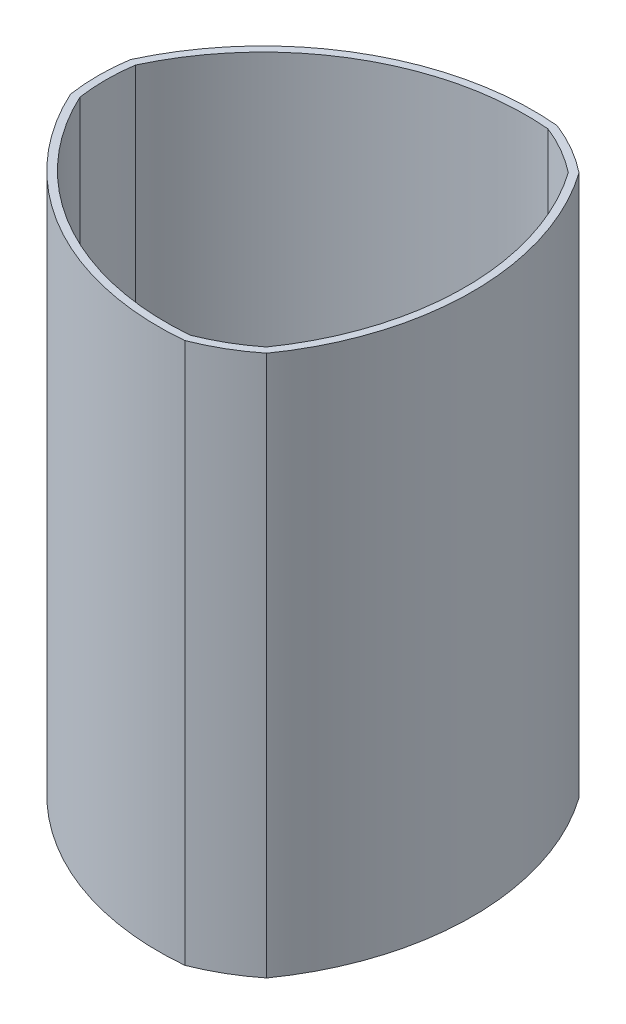
ISO-10303-21;
HEADER;
FILE_DESCRIPTION(('STEP AP214'),'2;1');
FILE_NAME('part.step','',(''),(''),'','','');
FILE_SCHEMA(('AUTOMOTIVE_DESIGN { 1 0 10303 214 1 1 1 1 }'));
ENDSEC;
DATA;
#1=APPLICATION_CONTEXT('core data for automotive mechanical design processes');
#2=APPLICATION_PROTOCOL_DEFINITION('international standard','automotive_design',2000,#1);
#3=PRODUCT_CONTEXT('',#1,'mechanical');
#4=PRODUCT('Part','Part','',(#3));
#5=PRODUCT_RELATED_PRODUCT_CATEGORY('part','',(#4));
#6=PRODUCT_DEFINITION_FORMATION('','',#4);
#7=PRODUCT_DEFINITION_CONTEXT('part definition',#1,'design');
#8=PRODUCT_DEFINITION('design','',#6,#7);
#9=PRODUCT_DEFINITION_SHAPE('','',#8);
#10=(LENGTH_UNIT() NAMED_UNIT(*) SI_UNIT(.MILLI.,.METRE.));
#11=(NAMED_UNIT(*) PLANE_ANGLE_UNIT() SI_UNIT($,.RADIAN.));
#12=(NAMED_UNIT(*) SI_UNIT($,.STERADIAN.) SOLID_ANGLE_UNIT());
#13=UNCERTAINTY_MEASURE_WITH_UNIT(LENGTH_MEASURE(1.E-05),#10,'distance_accuracy_value','');
#14=(GEOMETRIC_REPRESENTATION_CONTEXT(3) GLOBAL_UNCERTAINTY_ASSIGNED_CONTEXT((#13)) GLOBAL_UNIT_ASSIGNED_CONTEXT((#10,
#11,#12)) REPRESENTATION_CONTEXT('',''));
#15=CARTESIAN_POINT('',(0.,0.,0.));
#16=DIRECTION('',(0.,0.,1.));
#17=DIRECTION('',(1.,0.,0.));
#18=AXIS2_PLACEMENT_3D('',#15,#16,#17);
#19=CARTESIAN_POINT('',(10.1537856011036,228.599999999999,-17.5868725502727));
#20=DIRECTION('',(0.,-1.,0.));
#21=DIRECTION('',(0.,0.,-1.));
#22=AXIS2_PLACEMENT_3D('',#19,#20,#21);
#23=PLANE('',#22);
#24=CARTESIAN_POINT('',(20.3075712022071,228.599999999999,-35.1737451005455));
#25=DIRECTION('',(0.,1.,0.));
#26=DIRECTION('',(0.,0.,-1.));
#27=AXIS2_PLACEMENT_3D('',#24,#25,#26);
#28=CIRCLE('',#27,114.3);
#29=CARTESIAN_POINT('',(-83.500112781954,228.599999999999,12.664051105431));
#30=VERTEX_POINT('',#29);
#31=CARTESIAN_POINT('',(30.7826664188494,228.599999999999,78.6452444407533));
#32=VERTEX_POINT('',#31);
#33=EDGE_CURVE('E294',#30,#32,#28,.T.);
#34=ORIENTED_EDGE('',*,*,#33,.T.);
#35=CARTESIAN_POINT('',(0.,228.599999999999,0.));
#36=DIRECTION('',(0.,1.,0.));
#37=DIRECTION('',(0.,0.,1.));
#38=AXIS2_PLACEMENT_3D('',#35,#36,#37);
#39=CIRCLE('',#38,84.455);
#40=CARTESIAN_POINT('',(52.7174463631047,228.599999999999,65.9811933353223));
#41=VERTEX_POINT('',#40);
#42=EDGE_CURVE('E297',#32,#41,#39,.T.);
#43=ORIENTED_EDGE('',*,*,#42,.T.);
#44=CARTESIAN_POINT('',(-40.6151424044144,228.599999999999,0.));
#45=DIRECTION('',(0.,1.,0.));
#46=DIRECTION('',(0.,0.,-1.));
#47=AXIS2_PLACEMENT_3D('',#44,#45,#46);
#48=CIRCLE('',#47,114.3);
#49=CARTESIAN_POINT('',(52.7174463631046,228.599999999999,-65.9811933353224));
#50=VERTEX_POINT('',#49);
#51=EDGE_CURVE('E300',#41,#50,#48,.T.);
#52=ORIENTED_EDGE('',*,*,#51,.T.);
#53=CARTESIAN_POINT('',(0.,228.599999999999,0.));
#54=DIRECTION('',(0.,1.,0.));
#55=DIRECTION('',(0.,0.,1.));
#56=AXIS2_PLACEMENT_3D('',#53,#54,#55);
#57=CIRCLE('',#56,84.455);
#58=CARTESIAN_POINT('',(30.7826664188494,228.599999999999,-78.6452444407534));
#59=VERTEX_POINT('',#58);
#60=EDGE_CURVE('E302',#50,#59,#57,.T.);
#61=ORIENTED_EDGE('',*,*,#60,.T.);
#62=CARTESIAN_POINT('',(20.3075712022072,228.599999999999,35.1737451005455));
#63=DIRECTION('',(0.,1.,0.));
#64=DIRECTION('',(0.,0.,-1.));
#65=AXIS2_PLACEMENT_3D('',#62,#63,#64);
#66=CIRCLE('',#65,114.3);
#67=CARTESIAN_POINT('',(-83.500112781954,228.599999999999,-12.664051105431));
#68=VERTEX_POINT('',#67);
#69=EDGE_CURVE('E304',#59,#68,#66,.T.);
#70=ORIENTED_EDGE('',*,*,#69,.T.);
#71=CARTESIAN_POINT('',(0.,228.599999999999,0.));
#72=DIRECTION('',(0.,1.,0.));
#73=DIRECTION('',(0.,0.,1.));
#74=AXIS2_PLACEMENT_3D('',#71,#72,#73);
#75=CIRCLE('',#74,84.455);
#76=EDGE_CURVE('E306',#68,#30,#75,.T.);
#77=ORIENTED_EDGE('',*,*,#76,.T.);
#78=EDGE_LOOP('',(#34,#43,#52,#61,#70,#77));
#79=FACE_BOUND('',#78,.T.);
#80=CARTESIAN_POINT('',(0.,228.599999999999,0.));
#81=DIRECTION('',(0.,1.,0.));
#82=DIRECTION('',(0.,0.,1.));
#83=AXIS2_PLACEMENT_3D('',#80,#81,#82);
#84=CIRCLE('',#83,81.28);
#85=CARTESIAN_POINT('',(50.3843787092607,228.599999999999,-63.7797207745675));
#86=VERTEX_POINT('',#85);
#87=CARTESIAN_POINT('',(30.0426690824231,228.599999999999,-75.5240123033993));
#88=VERTEX_POINT('',#87);
#89=EDGE_CURVE('E263',#86,#88,#84,.T.);
#90=ORIENTED_EDGE('',*,*,#89,.F.);
#91=CARTESIAN_POINT('',(-40.6151424044144,228.599999999999,0.));
#92=DIRECTION('',(0.,1.,0.));
#93=DIRECTION('',(0.,0.,-1.));
#94=AXIS2_PLACEMENT_3D('',#91,#92,#93);
#95=CIRCLE('',#94,111.125);
#96=CARTESIAN_POINT('',(50.3843787092608,228.599999999999,63.7797207745674));
#97=VERTEX_POINT('',#96);
#98=EDGE_CURVE('E274',#97,#86,#95,.T.);
#99=ORIENTED_EDGE('',*,*,#98,.F.);
#100=CARTESIAN_POINT('',(0.,228.599999999999,0.));
#101=DIRECTION('',(0.,1.,0.));
#102=DIRECTION('',(0.,0.,1.));
#103=AXIS2_PLACEMENT_3D('',#100,#101,#102);
#104=CIRCLE('',#103,81.28);
#105=CARTESIAN_POINT('',(30.0426690824233,228.599999999999,75.5240123033993));
#106=VERTEX_POINT('',#105);
#107=EDGE_CURVE('E271',#106,#97,#104,.T.);
#108=ORIENTED_EDGE('',*,*,#107,.F.);
#109=CARTESIAN_POINT('',(20.3075712022071,228.599999999999,-35.1737451005455));
#110=DIRECTION('',(0.,1.,0.));
#111=DIRECTION('',(0.,0.,-1.));
#112=AXIS2_PLACEMENT_3D('',#109,#110,#111);
#113=CIRCLE('',#112,111.125);
#114=CARTESIAN_POINT('',(-80.4270477916838,228.599999999999,11.7442915288321));
#115=VERTEX_POINT('',#114);
#116=EDGE_CURVE('E269',#115,#106,#113,.T.);
#117=ORIENTED_EDGE('',*,*,#116,.F.);
#118=CARTESIAN_POINT('',(0.,228.599999999999,0.));
#119=DIRECTION('',(0.,1.,0.));
#120=DIRECTION('',(0.,0.,1.));
#121=AXIS2_PLACEMENT_3D('',#118,#119,#120);
#122=CIRCLE('',#121,81.28);
#123=CARTESIAN_POINT('',(-80.4270477916839,228.599999999999,-11.7442915288319));
#124=VERTEX_POINT('',#123);
#125=EDGE_CURVE('E267',#124,#115,#122,.T.);
#126=ORIENTED_EDGE('',*,*,#125,.F.);
#127=CARTESIAN_POINT('',(20.3075712022072,228.599999999999,35.1737451005455));
#128=DIRECTION('',(0.,1.,0.));
#129=DIRECTION('',(0.,0.,-1.));
#130=AXIS2_PLACEMENT_3D('',#127,#128,#129);
#131=CIRCLE('',#130,111.125);
#132=EDGE_CURVE('E265',#88,#124,#131,.T.);
#133=ORIENTED_EDGE('',*,*,#132,.F.);
#134=EDGE_LOOP('',(#90,#99,#108,#117,#126,#133));
#135=FACE_BOUND('',#134,.T.);
#136=ADVANCED_FACE('F38',(#79,#135),#23,.F.);
#137=CARTESIAN_POINT('',(10.1537856011036,0.,-17.5868725502727));
#138=DIRECTION('',(0.,-1.,0.));
#139=DIRECTION('',(0.,0.,-1.));
#140=AXIS2_PLACEMENT_3D('',#137,#138,#139);
#141=PLANE('',#140);
#142=DIRECTION('',(0.,0.,1.));
#143=VECTOR('',#142,1.);
#144=CARTESIAN_POINT('',(-6.60400000000001,0.,-44.7675));
#145=LINE('',#144,#143);
#146=CARTESIAN_POINT('',(-6.60400000000001,0.,-44.7675));
#147=VERTEX_POINT('',#146);
#148=CARTESIAN_POINT('',(-6.60400000000001,0.,-43.2435));
#149=VERTEX_POINT('',#148);
#150=EDGE_CURVE('E179',#147,#149,#145,.T.);
#151=ORIENTED_EDGE('',*,*,#150,.T.);
#152=DIRECTION('',(1.,0.,0.));
#153=VECTOR('',#152,1.);
#154=CARTESIAN_POINT('',(-6.60400000000001,0.,-43.2435));
#155=LINE('',#154,#153);
#156=CARTESIAN_POINT('',(6.60399999999999,0.,-43.2435));
#157=VERTEX_POINT('',#156);
#158=EDGE_CURVE('E190',#149,#157,#155,.T.);
#159=ORIENTED_EDGE('',*,*,#158,.T.);
#160=DIRECTION('',(0.,0.,-1.));
#161=VECTOR('',#160,1.);
#162=CARTESIAN_POINT('',(6.60399999999999,0.,-44.7675));
#163=LINE('',#162,#161);
#164=CARTESIAN_POINT('',(6.60399999999999,0.,-44.7675));
#165=VERTEX_POINT('',#164);
#166=EDGE_CURVE('E53',#157,#165,#163,.T.);
#167=ORIENTED_EDGE('',*,*,#166,.T.);
#168=DIRECTION('',(-1.,0.,0.));
#169=VECTOR('',#168,1.);
#170=CARTESIAN_POINT('',(-6.60400000000001,0.,-44.7675));
#171=LINE('',#170,#169);
#172=EDGE_CURVE('E187',#165,#147,#171,.T.);
#173=ORIENTED_EDGE('',*,*,#172,.T.);
#174=EDGE_LOOP('',(#151,#159,#167,#173));
#175=FACE_BOUND('',#174,.T.);
#176=DIRECTION('',(0.,0.,1.));
#177=VECTOR('',#176,1.);
#178=CARTESIAN_POINT('',(-6.604,0.,44.7675));
#179=LINE('',#178,#177);
#180=CARTESIAN_POINT('',(-6.604,0.,44.7675));
#181=VERTEX_POINT('',#180);
#182=CARTESIAN_POINT('',(-6.604,0.,46.2915));
#183=VERTEX_POINT('',#182);
#184=EDGE_CURVE('E217',#181,#183,#179,.T.);
#185=ORIENTED_EDGE('',*,*,#184,.T.);
#186=DIRECTION('',(1.,0.,0.));
#187=VECTOR('',#186,1.);
#188=CARTESIAN_POINT('',(-6.604,0.,46.2915));
#189=LINE('',#188,#187);
#190=CARTESIAN_POINT('',(6.604,0.,46.2915));
#191=VERTEX_POINT('',#190);
#192=EDGE_CURVE('E220',#183,#191,#189,.T.);
#193=ORIENTED_EDGE('',*,*,#192,.T.);
#194=DIRECTION('',(0.,0.,-1.));
#195=VECTOR('',#194,1.);
#196=CARTESIAN_POINT('',(6.604,0.,44.7675));
#197=LINE('',#196,#195);
#198=CARTESIAN_POINT('',(6.604,0.,44.7675));
#199=VERTEX_POINT('',#198);
#200=EDGE_CURVE('E61',#191,#199,#197,.T.);
#201=ORIENTED_EDGE('',*,*,#200,.T.);
#202=DIRECTION('',(-1.,0.,0.));
#203=VECTOR('',#202,1.);
#204=CARTESIAN_POINT('',(-6.604,0.,44.7675));
#205=LINE('',#204,#203);
#206=EDGE_CURVE('E225',#199,#181,#205,.T.);
#207=ORIENTED_EDGE('',*,*,#206,.T.);
#208=EDGE_LOOP('',(#185,#193,#201,#207));
#209=FACE_BOUND('',#208,.T.);
#210=CARTESIAN_POINT('',(20.3075712022071,0.,-35.1737451005455));
#211=DIRECTION('',(0.,1.,0.));
#212=DIRECTION('',(0.,0.,-1.));
#213=AXIS2_PLACEMENT_3D('',#210,#211,#212);
#214=CIRCLE('',#213,114.3);
#215=CARTESIAN_POINT('',(-83.500112781954,0.,12.664051105431));
#216=VERTEX_POINT('',#215);
#217=CARTESIAN_POINT('',(30.7826664188494,0.,78.6452444407533));
#218=VERTEX_POINT('',#217);
#219=EDGE_CURVE('E293',#216,#218,#214,.T.);
#220=ORIENTED_EDGE('',*,*,#219,.F.);
#221=CARTESIAN_POINT('',(0.,0.,0.));
#222=DIRECTION('',(0.,1.,0.));
#223=DIRECTION('',(0.,0.,1.));
#224=AXIS2_PLACEMENT_3D('',#221,#222,#223);
#225=CIRCLE('',#224,84.455);
#226=CARTESIAN_POINT('',(-83.500112781954,0.,-12.664051105431));
#227=VERTEX_POINT('',#226);
#228=EDGE_CURVE('E298',#227,#216,#225,.T.);
#229=ORIENTED_EDGE('',*,*,#228,.F.);
#230=CARTESIAN_POINT('',(20.3075712022072,0.,35.1737451005455));
#231=DIRECTION('',(0.,1.,0.));
#232=DIRECTION('',(0.,0.,-1.));
#233=AXIS2_PLACEMENT_3D('',#230,#231,#232);
#234=CIRCLE('',#233,114.3);
#235=CARTESIAN_POINT('',(30.7826664188494,0.,-78.6452444407534));
#236=VERTEX_POINT('',#235);
#237=EDGE_CURVE('E317',#236,#227,#234,.T.);
#238=ORIENTED_EDGE('',*,*,#237,.F.);
#239=CARTESIAN_POINT('',(0.,0.,0.));
#240=DIRECTION('',(0.,1.,0.));
#241=DIRECTION('',(0.,0.,1.));
#242=AXIS2_PLACEMENT_3D('',#239,#240,#241);
#243=CIRCLE('',#242,84.455);
#244=CARTESIAN_POINT('',(52.7174463631046,0.,-65.9811933353224));
#245=VERTEX_POINT('',#244);
#246=EDGE_CURVE('E315',#245,#236,#243,.T.);
#247=ORIENTED_EDGE('',*,*,#246,.F.);
#248=CARTESIAN_POINT('',(-40.6151424044144,0.,0.));
#249=DIRECTION('',(0.,1.,0.));
#250=DIRECTION('',(0.,0.,-1.));
#251=AXIS2_PLACEMENT_3D('',#248,#249,#250);
#252=CIRCLE('',#251,114.3);
#253=CARTESIAN_POINT('',(52.7174463631047,0.,65.9811933353223));
#254=VERTEX_POINT('',#253);
#255=EDGE_CURVE('E313',#254,#245,#252,.T.);
#256=ORIENTED_EDGE('',*,*,#255,.F.);
#257=CARTESIAN_POINT('',(0.,0.,0.));
#258=DIRECTION('',(0.,1.,0.));
#259=DIRECTION('',(0.,0.,1.));
#260=AXIS2_PLACEMENT_3D('',#257,#258,#259);
#261=CIRCLE('',#260,84.455);
#262=EDGE_CURVE('E311',#218,#254,#261,.T.);
#263=ORIENTED_EDGE('',*,*,#262,.F.);
#264=EDGE_LOOP('',(#220,#229,#238,#247,#256,#263));
#265=FACE_BOUND('',#264,.T.);
#266=ADVANCED_FACE('F194',(#175,#209,#265),#141,.T.);
#267=CARTESIAN_POINT('',(20.3075712022071,228.599999999999,-35.1737451005455));
#268=DIRECTION('',(0.,-1.,0.));
#269=DIRECTION('',(0.,0.,-1.));
#270=AXIS2_PLACEMENT_3D('',#267,#268,#269);
#271=CYLINDRICAL_SURFACE('',#270,114.3);
#272=ORIENTED_EDGE('',*,*,#219,.T.);
#273=DIRECTION('',(0.,-1.,0.));
#274=VECTOR('',#273,1.);
#275=CARTESIAN_POINT('',(30.7826664188494,228.599999999999,78.6452444407533));
#276=LINE('',#275,#274);
#277=EDGE_CURVE('E11',#32,#218,#276,.T.);
#278=ORIENTED_EDGE('',*,*,#277,.F.);
#279=ORIENTED_EDGE('',*,*,#33,.F.);
#280=DIRECTION('',(0.,-1.,0.));
#281=VECTOR('',#280,1.);
#282=CARTESIAN_POINT('',(-83.500112781954,228.599999999999,12.664051105431));
#283=LINE('',#282,#281);
#284=EDGE_CURVE('E308',#30,#216,#283,.T.);
#285=ORIENTED_EDGE('',*,*,#284,.T.);
#286=EDGE_LOOP('',(#272,#278,#279,#285));
#287=FACE_BOUND('',#286,.T.);
#288=ADVANCED_FACE('F40',(#287),#271,.T.);
#289=CARTESIAN_POINT('',(0.,228.599999999999,0.));
#290=DIRECTION('',(0.,-1.,0.));
#291=DIRECTION('',(0.,0.,-1.));
#292=AXIS2_PLACEMENT_3D('',#289,#290,#291);
#293=CYLINDRICAL_SURFACE('',#292,84.455);
#294=ORIENTED_EDGE('',*,*,#262,.T.);
#295=DIRECTION('',(0.,-1.,0.));
#296=VECTOR('',#295,1.);
#297=CARTESIAN_POINT('',(52.7174463631047,228.599999999999,65.9811933353223));
#298=LINE('',#297,#296);
#299=EDGE_CURVE('E46',#41,#254,#298,.T.);
#300=ORIENTED_EDGE('',*,*,#299,.F.);
#301=ORIENTED_EDGE('',*,*,#42,.F.);
#302=ORIENTED_EDGE('',*,*,#277,.T.);
#303=EDGE_LOOP('',(#294,#300,#301,#302));
#304=FACE_BOUND('',#303,.T.);
#305=ADVANCED_FACE('F357',(#304),#293,.T.);
#306=CARTESIAN_POINT('',(-40.6151424044144,228.599999999999,0.));
#307=DIRECTION('',(0.,-1.,0.));
#308=DIRECTION('',(0.,0.,-1.));
#309=AXIS2_PLACEMENT_3D('',#306,#307,#308);
#310=CYLINDRICAL_SURFACE('',#309,114.3);
#311=ORIENTED_EDGE('',*,*,#255,.T.);
#312=DIRECTION('',(0.,-1.,0.));
#313=VECTOR('',#312,1.);
#314=CARTESIAN_POINT('',(52.7174463631046,228.599999999999,-65.9811933353224));
#315=LINE('',#314,#313);
#316=EDGE_CURVE('E328',#50,#245,#315,.T.);
#317=ORIENTED_EDGE('',*,*,#316,.F.);
#318=ORIENTED_EDGE('',*,*,#51,.F.);
#319=ORIENTED_EDGE('',*,*,#299,.T.);
#320=EDGE_LOOP('',(#311,#317,#318,#319));
#321=FACE_BOUND('',#320,.T.);
#322=ADVANCED_FACE('F335',(#321),#310,.T.);
#323=CARTESIAN_POINT('',(0.,228.599999999999,0.));
#324=DIRECTION('',(0.,-1.,0.));
#325=DIRECTION('',(0.,0.,-1.));
#326=AXIS2_PLACEMENT_3D('',#323,#324,#325);
#327=CYLINDRICAL_SURFACE('',#326,84.455);
#328=ORIENTED_EDGE('',*,*,#246,.T.);
#329=DIRECTION('',(0.,-1.,0.));
#330=VECTOR('',#329,1.);
#331=CARTESIAN_POINT('',(30.7826664188494,228.599999999999,-78.6452444407534));
#332=LINE('',#331,#330);
#333=EDGE_CURVE('E325',#59,#236,#332,.T.);
#334=ORIENTED_EDGE('',*,*,#333,.F.);
#335=ORIENTED_EDGE('',*,*,#60,.F.);
#336=ORIENTED_EDGE('',*,*,#316,.T.);
#337=EDGE_LOOP('',(#328,#334,#335,#336));
#338=FACE_BOUND('',#337,.T.);
#339=ADVANCED_FACE('F345',(#338),#327,.T.);
#340=CARTESIAN_POINT('',(20.3075712022072,228.599999999999,35.1737451005455));
#341=DIRECTION('',(0.,-1.,0.));
#342=DIRECTION('',(0.,0.,-1.));
#343=AXIS2_PLACEMENT_3D('',#340,#341,#342);
#344=CYLINDRICAL_SURFACE('',#343,114.3);
#345=ORIENTED_EDGE('',*,*,#237,.T.);
#346=DIRECTION('',(0.,-1.,0.));
#347=VECTOR('',#346,1.);
#348=CARTESIAN_POINT('',(-83.500112781954,228.599999999999,-12.664051105431));
#349=LINE('',#348,#347);
#350=EDGE_CURVE('E322',#68,#227,#349,.T.);
#351=ORIENTED_EDGE('',*,*,#350,.F.);
#352=ORIENTED_EDGE('',*,*,#69,.F.);
#353=ORIENTED_EDGE('',*,*,#333,.T.);
#354=EDGE_LOOP('',(#345,#351,#352,#353));
#355=FACE_BOUND('',#354,.T.);
#356=ADVANCED_FACE('F349',(#355),#344,.T.);
#357=CARTESIAN_POINT('',(0.,228.599999999999,0.));
#358=DIRECTION('',(0.,-1.,0.));
#359=DIRECTION('',(0.,0.,-1.));
#360=AXIS2_PLACEMENT_3D('',#357,#358,#359);
#361=CYLINDRICAL_SURFACE('',#360,84.455);
#362=ORIENTED_EDGE('',*,*,#228,.T.);
#363=ORIENTED_EDGE('',*,*,#284,.F.);
#364=ORIENTED_EDGE('',*,*,#76,.F.);
#365=ORIENTED_EDGE('',*,*,#350,.T.);
#366=EDGE_LOOP('',(#362,#363,#364,#365));
#367=FACE_BOUND('',#366,.T.);
#368=ADVANCED_FACE('F360',(#367),#361,.T.);
#369=CARTESIAN_POINT('',(0.,228.599999999999,0.));
#370=DIRECTION('',(0.,-1.,0.));
#371=DIRECTION('',(0.,0.,-1.));
#372=AXIS2_PLACEMENT_3D('',#369,#370,#371);
#373=CYLINDRICAL_SURFACE('',#372,81.28);
#374=CARTESIAN_POINT('',(0.,3.175,0.));
#375=DIRECTION('',(0.,1.,0.));
#376=DIRECTION('',(0.,0.,1.));
#377=AXIS2_PLACEMENT_3D('',#374,#375,#376);
#378=CIRCLE('',#377,81.28);
#379=CARTESIAN_POINT('',(50.3843787092607,3.175,-63.7797207745675));
#380=VERTEX_POINT('',#379);
#381=CARTESIAN_POINT('',(30.0426690824231,3.17500000000001,-75.5240123033993));
#382=VERTEX_POINT('',#381);
#383=EDGE_CURVE('E248',#380,#382,#378,.T.);
#384=ORIENTED_EDGE('',*,*,#383,.F.);
#385=DIRECTION('',(0.,-1.,0.));
#386=VECTOR('',#385,1.);
#387=CARTESIAN_POINT('',(50.3843787092607,228.599999999999,-63.7797207745675));
#388=LINE('',#387,#386);
#389=EDGE_CURVE('E276',#86,#380,#388,.T.);
#390=ORIENTED_EDGE('',*,*,#389,.F.);
#391=ORIENTED_EDGE('',*,*,#89,.T.);
#392=DIRECTION('',(0.,-1.,0.));
#393=VECTOR('',#392,1.);
#394=CARTESIAN_POINT('',(30.0426690824231,228.599999999999,-75.5240123033993));
#395=LINE('',#394,#393);
#396=EDGE_CURVE('E290',#88,#382,#395,.T.);
#397=ORIENTED_EDGE('',*,*,#396,.T.);
#398=EDGE_LOOP('',(#384,#390,#391,#397));
#399=FACE_BOUND('',#398,.T.);
#400=ADVANCED_FACE('F362',(#399),#373,.F.);
#401=CARTESIAN_POINT('',(20.3075712022072,228.599999999999,35.1737451005455));
#402=DIRECTION('',(0.,-1.,0.));
#403=DIRECTION('',(0.,0.,-1.));
#404=AXIS2_PLACEMENT_3D('',#401,#402,#403);
#405=CYLINDRICAL_SURFACE('',#404,111.125);
#406=CARTESIAN_POINT('',(20.3075712022072,3.175,35.1737451005455));
#407=DIRECTION('',(0.,1.,0.));
#408=DIRECTION('',(0.,0.,1.));
#409=AXIS2_PLACEMENT_3D('',#406,#407,#408);
#410=CIRCLE('',#409,111.125);
#411=CARTESIAN_POINT('',(-80.4270477916839,3.17500000000001,-11.7442915288319));
#412=VERTEX_POINT('',#411);
#413=EDGE_CURVE('E251',#382,#412,#410,.T.);
#414=ORIENTED_EDGE('',*,*,#413,.F.);
#415=ORIENTED_EDGE('',*,*,#396,.F.);
#416=ORIENTED_EDGE('',*,*,#132,.T.);
#417=DIRECTION('',(0.,-1.,0.));
#418=VECTOR('',#417,1.);
#419=CARTESIAN_POINT('',(-80.4270477916839,228.599999999999,-11.7442915288319));
#420=LINE('',#419,#418);
#421=EDGE_CURVE('E287',#124,#412,#420,.T.);
#422=ORIENTED_EDGE('',*,*,#421,.T.);
#423=EDGE_LOOP('',(#414,#415,#416,#422));
#424=FACE_BOUND('',#423,.T.);
#425=ADVANCED_FACE('F368',(#424),#405,.F.);
#426=CARTESIAN_POINT('',(0.,228.599999999999,0.));
#427=DIRECTION('',(0.,-1.,0.));
#428=DIRECTION('',(0.,0.,-1.));
#429=AXIS2_PLACEMENT_3D('',#426,#427,#428);
#430=CYLINDRICAL_SURFACE('',#429,81.28);
#431=CARTESIAN_POINT('',(0.,3.175,0.));
#432=DIRECTION('',(0.,1.,0.));
#433=DIRECTION('',(0.,0.,1.));
#434=AXIS2_PLACEMENT_3D('',#431,#432,#433);
#435=CIRCLE('',#434,81.28);
#436=CARTESIAN_POINT('',(-80.4270477916838,3.17500000000001,11.7442915288321));
#437=VERTEX_POINT('',#436);
#438=EDGE_CURVE('E254',#412,#437,#435,.T.);
#439=ORIENTED_EDGE('',*,*,#438,.F.);
#440=ORIENTED_EDGE('',*,*,#421,.F.);
#441=ORIENTED_EDGE('',*,*,#125,.T.);
#442=DIRECTION('',(0.,-1.,0.));
#443=VECTOR('',#442,1.);
#444=CARTESIAN_POINT('',(-80.4270477916838,228.599999999999,11.7442915288321));
#445=LINE('',#444,#443);
#446=EDGE_CURVE('E284',#115,#437,#445,.T.);
#447=ORIENTED_EDGE('',*,*,#446,.T.);
#448=EDGE_LOOP('',(#439,#440,#441,#447));
#449=FACE_BOUND('',#448,.T.);
#450=ADVANCED_FACE('F382',(#449),#430,.F.);
#451=CARTESIAN_POINT('',(20.3075712022071,228.599999999999,-35.1737451005455));
#452=DIRECTION('',(0.,-1.,0.));
#453=DIRECTION('',(0.,0.,-1.));
#454=AXIS2_PLACEMENT_3D('',#451,#452,#453);
#455=CYLINDRICAL_SURFACE('',#454,111.125);
#456=CARTESIAN_POINT('',(20.3075712022071,3.175,-35.1737451005455));
#457=DIRECTION('',(0.,1.,0.));
#458=DIRECTION('',(0.,0.,1.));
#459=AXIS2_PLACEMENT_3D('',#456,#457,#458);
#460=CIRCLE('',#459,111.125);
#461=CARTESIAN_POINT('',(30.0426690824233,3.17500000000001,75.5240123033993));
#462=VERTEX_POINT('',#461);
#463=EDGE_CURVE('E257',#437,#462,#460,.T.);
#464=ORIENTED_EDGE('',*,*,#463,.F.);
#465=ORIENTED_EDGE('',*,*,#446,.F.);
#466=ORIENTED_EDGE('',*,*,#116,.T.);
#467=DIRECTION('',(0.,-1.,0.));
#468=VECTOR('',#467,1.);
#469=CARTESIAN_POINT('',(30.0426690824233,228.599999999999,75.5240123033993));
#470=LINE('',#469,#468);
#471=EDGE_CURVE('E281',#106,#462,#470,.T.);
#472=ORIENTED_EDGE('',*,*,#471,.T.);
#473=EDGE_LOOP('',(#464,#465,#466,#472));
#474=FACE_BOUND('',#473,.T.);
#475=ADVANCED_FACE('F386',(#474),#455,.F.);
#476=CARTESIAN_POINT('',(0.,228.599999999999,0.));
#477=DIRECTION('',(0.,-1.,0.));
#478=DIRECTION('',(0.,0.,-1.));
#479=AXIS2_PLACEMENT_3D('',#476,#477,#478);
#480=CYLINDRICAL_SURFACE('',#479,81.28);
#481=CARTESIAN_POINT('',(0.,3.175,0.));
#482=DIRECTION('',(0.,1.,0.));
#483=DIRECTION('',(0.,0.,1.));
#484=AXIS2_PLACEMENT_3D('',#481,#482,#483);
#485=CIRCLE('',#484,81.28);
#486=CARTESIAN_POINT('',(50.3843787092608,3.17500000000001,63.7797207745674));
#487=VERTEX_POINT('',#486);
#488=EDGE_CURVE('E260',#462,#487,#485,.T.);
#489=ORIENTED_EDGE('',*,*,#488,.F.);
#490=ORIENTED_EDGE('',*,*,#471,.F.);
#491=ORIENTED_EDGE('',*,*,#107,.T.);
#492=DIRECTION('',(0.,-1.,0.));
#493=VECTOR('',#492,1.);
#494=CARTESIAN_POINT('',(50.3843787092608,228.599999999999,63.7797207745674));
#495=LINE('',#494,#493);
#496=EDGE_CURVE('E278',#97,#487,#495,.T.);
#497=ORIENTED_EDGE('',*,*,#496,.T.);
#498=EDGE_LOOP('',(#489,#490,#491,#497));
#499=FACE_BOUND('',#498,.T.);
#500=ADVANCED_FACE('F390',(#499),#480,.F.);
#501=CARTESIAN_POINT('',(-40.6151424044144,228.599999999999,0.));
#502=DIRECTION('',(0.,-1.,0.));
#503=DIRECTION('',(0.,0.,-1.));
#504=AXIS2_PLACEMENT_3D('',#501,#502,#503);
#505=CYLINDRICAL_SURFACE('',#504,111.125);
#506=CARTESIAN_POINT('',(-40.6151424044144,3.175,0.));
#507=DIRECTION('',(0.,1.,0.));
#508=DIRECTION('',(0.,0.,1.));
#509=AXIS2_PLACEMENT_3D('',#506,#507,#508);
#510=CIRCLE('',#509,111.125);
#511=EDGE_CURVE('E213',#487,#380,#510,.T.);
#512=ORIENTED_EDGE('',*,*,#511,.F.);
#513=ORIENTED_EDGE('',*,*,#496,.F.);
#514=ORIENTED_EDGE('',*,*,#98,.T.);
#515=ORIENTED_EDGE('',*,*,#389,.T.);
#516=EDGE_LOOP('',(#512,#513,#514,#515));
#517=FACE_BOUND('',#516,.T.);
#518=ADVANCED_FACE('F394',(#517),#505,.F.);
#519=CARTESIAN_POINT('',(-20.3075712022072,3.175,0.));
#520=DIRECTION('',(0.,1.,0.));
#521=DIRECTION('',(0.,0.,1.));
#522=AXIS2_PLACEMENT_3D('',#519,#520,#521);
#523=PLANE('',#522);
#524=DIRECTION('',(0.,0.,1.));
#525=VECTOR('',#524,1.);
#526=CARTESIAN_POINT('',(-6.60400000000001,3.175,-44.7675));
#527=LINE('',#526,#525);
#528=CARTESIAN_POINT('',(-6.60400000000001,3.175,-44.7675));
#529=VERTEX_POINT('',#528);
#530=CARTESIAN_POINT('',(-6.60400000000001,3.175,-43.2435));
#531=VERTEX_POINT('',#530);
#532=EDGE_CURVE('E182',#529,#531,#527,.T.);
#533=ORIENTED_EDGE('',*,*,#532,.F.);
#534=DIRECTION('',(-1.,0.,0.));
#535=VECTOR('',#534,1.);
#536=CARTESIAN_POINT('',(-6.60400000000001,3.175,-44.7675));
#537=LINE('',#536,#535);
#538=CARTESIAN_POINT('',(6.60399999999999,3.175,-44.7675));
#539=VERTEX_POINT('',#538);
#540=EDGE_CURVE('E197',#539,#529,#537,.T.);
#541=ORIENTED_EDGE('',*,*,#540,.F.);
#542=DIRECTION('',(0.,0.,-1.));
#543=VECTOR('',#542,1.);
#544=CARTESIAN_POINT('',(6.60399999999999,3.175,-44.7675));
#545=LINE('',#544,#543);
#546=CARTESIAN_POINT('',(6.60399999999999,3.175,-43.2435));
#547=VERTEX_POINT('',#546);
#548=EDGE_CURVE('E200',#547,#539,#545,.T.);
#549=ORIENTED_EDGE('',*,*,#548,.F.);
#550=DIRECTION('',(1.,0.,0.));
#551=VECTOR('',#550,1.);
#552=CARTESIAN_POINT('',(-6.60400000000001,3.175,-43.2435));
#553=LINE('',#552,#551);
#554=EDGE_CURVE('E206',#531,#547,#553,.T.);
#555=ORIENTED_EDGE('',*,*,#554,.F.);
#556=EDGE_LOOP('',(#533,#541,#549,#555));
#557=FACE_BOUND('',#556,.T.);
#558=DIRECTION('',(0.,0.,1.));
#559=VECTOR('',#558,1.);
#560=CARTESIAN_POINT('',(-6.604,3.175,44.7675));
#561=LINE('',#560,#559);
#562=CARTESIAN_POINT('',(-6.604,3.175,44.7675));
#563=VERTEX_POINT('',#562);
#564=CARTESIAN_POINT('',(-6.604,3.175,46.2915));
#565=VERTEX_POINT('',#564);
#566=EDGE_CURVE('E229',#563,#565,#561,.T.);
#567=ORIENTED_EDGE('',*,*,#566,.F.);
#568=DIRECTION('',(-1.,0.,0.));
#569=VECTOR('',#568,1.);
#570=CARTESIAN_POINT('',(-6.604,3.175,44.7675));
#571=LINE('',#570,#569);
#572=CARTESIAN_POINT('',(6.604,3.175,44.7675));
#573=VERTEX_POINT('',#572);
#574=EDGE_CURVE('E221',#573,#563,#571,.T.);
#575=ORIENTED_EDGE('',*,*,#574,.F.);
#576=DIRECTION('',(0.,0.,-1.));
#577=VECTOR('',#576,1.);
#578=CARTESIAN_POINT('',(6.604,3.175,44.7675));
#579=LINE('',#578,#577);
#580=CARTESIAN_POINT('',(6.604,3.175,46.2915));
#581=VERTEX_POINT('',#580);
#582=EDGE_CURVE('E234',#581,#573,#579,.T.);
#583=ORIENTED_EDGE('',*,*,#582,.F.);
#584=DIRECTION('',(1.,0.,0.));
#585=VECTOR('',#584,1.);
#586=CARTESIAN_POINT('',(-6.604,3.175,46.2915));
#587=LINE('',#586,#585);
#588=EDGE_CURVE('E231',#565,#581,#587,.T.);
#589=ORIENTED_EDGE('',*,*,#588,.F.);
#590=EDGE_LOOP('',(#567,#575,#583,#589));
#591=FACE_BOUND('',#590,.T.);
#592=ORIENTED_EDGE('',*,*,#511,.T.);
#593=ORIENTED_EDGE('',*,*,#383,.T.);
#594=ORIENTED_EDGE('',*,*,#413,.T.);
#595=ORIENTED_EDGE('',*,*,#438,.T.);
#596=ORIENTED_EDGE('',*,*,#463,.T.);
#597=ORIENTED_EDGE('',*,*,#488,.T.);
#598=EDGE_LOOP('',(#592,#593,#594,#595,#596,#597));
#599=FACE_BOUND('',#598,.T.);
#600=ADVANCED_FACE('F398',(#557,#591,#599),#523,.T.);
#601=CARTESIAN_POINT('',(-6.604,0.,44.7675));
#602=DIRECTION('',(-1.,0.,0.));
#603=DIRECTION('',(0.,0.,1.));
#604=AXIS2_PLACEMENT_3D('',#601,#602,#603);
#605=PLANE('',#604);
#606=ORIENTED_EDGE('',*,*,#566,.T.);
#607=DIRECTION('',(0.,1.,0.));
#608=VECTOR('',#607,1.);
#609=CARTESIAN_POINT('',(-6.604,0.,46.2915));
#610=LINE('',#609,#608);
#611=EDGE_CURVE('E228',#183,#565,#610,.T.);
#612=ORIENTED_EDGE('',*,*,#611,.F.);
#613=ORIENTED_EDGE('',*,*,#184,.F.);
#614=DIRECTION('',(0.,1.,0.));
#615=VECTOR('',#614,1.);
#616=CARTESIAN_POINT('',(-6.604,0.,44.7675));
#617=LINE('',#616,#615);
#618=EDGE_CURVE('E207',#181,#563,#617,.T.);
#619=ORIENTED_EDGE('',*,*,#618,.T.);
#620=EDGE_LOOP('',(#606,#612,#613,#619));
#621=FACE_BOUND('',#620,.T.);
#622=ADVANCED_FACE('F402',(#621),#605,.F.);
#623=CARTESIAN_POINT('',(-6.604,0.,44.7675));
#624=DIRECTION('',(0.,0.,-1.));
#625=DIRECTION('',(-1.,0.,0.));
#626=AXIS2_PLACEMENT_3D('',#623,#624,#625);
#627=PLANE('',#626);
#628=ORIENTED_EDGE('',*,*,#574,.T.);
#629=ORIENTED_EDGE('',*,*,#618,.F.);
#630=ORIENTED_EDGE('',*,*,#206,.F.);
#631=DIRECTION('',(0.,1.,0.));
#632=VECTOR('',#631,1.);
#633=CARTESIAN_POINT('',(6.604,0.,44.7675));
#634=LINE('',#633,#632);
#635=EDGE_CURVE('E240',#199,#573,#634,.T.);
#636=ORIENTED_EDGE('',*,*,#635,.T.);
#637=EDGE_LOOP('',(#628,#629,#630,#636));
#638=FACE_BOUND('',#637,.T.);
#639=ADVANCED_FACE('F406',(#638),#627,.F.);
#640=CARTESIAN_POINT('',(6.604,0.,44.7675));
#641=DIRECTION('',(1.,0.,0.));
#642=DIRECTION('',(0.,0.,-1.));
#643=AXIS2_PLACEMENT_3D('',#640,#641,#642);
#644=PLANE('',#643);
#645=ORIENTED_EDGE('',*,*,#582,.T.);
#646=ORIENTED_EDGE('',*,*,#635,.F.);
#647=ORIENTED_EDGE('',*,*,#200,.F.);
#648=DIRECTION('',(0.,1.,0.));
#649=VECTOR('',#648,1.);
#650=CARTESIAN_POINT('',(6.604,0.,46.2915));
#651=LINE('',#650,#649);
#652=EDGE_CURVE('E242',#191,#581,#651,.T.);
#653=ORIENTED_EDGE('',*,*,#652,.T.);
#654=EDGE_LOOP('',(#645,#646,#647,#653));
#655=FACE_BOUND('',#654,.T.);
#656=ADVANCED_FACE('F411',(#655),#644,.F.);
#657=CARTESIAN_POINT('',(-6.604,0.,46.2915));
#658=DIRECTION('',(0.,0.,1.));
#659=DIRECTION('',(1.,0.,0.));
#660=AXIS2_PLACEMENT_3D('',#657,#658,#659);
#661=PLANE('',#660);
#662=ORIENTED_EDGE('',*,*,#588,.T.);
#663=ORIENTED_EDGE('',*,*,#652,.F.);
#664=ORIENTED_EDGE('',*,*,#192,.F.);
#665=ORIENTED_EDGE('',*,*,#611,.T.);
#666=EDGE_LOOP('',(#662,#663,#664,#665));
#667=FACE_BOUND('',#666,.T.);
#668=ADVANCED_FACE('F408',(#667),#661,.F.);
#669=CARTESIAN_POINT('',(-6.60400000000001,0.,-44.7675));
#670=DIRECTION('',(-1.,0.,0.));
#671=DIRECTION('',(0.,0.,1.));
#672=AXIS2_PLACEMENT_3D('',#669,#670,#671);
#673=PLANE('',#672);
#674=ORIENTED_EDGE('',*,*,#532,.T.);
#675=DIRECTION('',(0.,1.,0.));
#676=VECTOR('',#675,1.);
#677=CARTESIAN_POINT('',(-6.60400000000001,0.,-43.2435));
#678=LINE('',#677,#676);
#679=EDGE_CURVE('E175',#149,#531,#678,.T.);
#680=ORIENTED_EDGE('',*,*,#679,.F.);
#681=ORIENTED_EDGE('',*,*,#150,.F.);
#682=DIRECTION('',(0.,1.,0.));
#683=VECTOR('',#682,1.);
#684=CARTESIAN_POINT('',(-6.60400000000001,0.,-44.7675));
#685=LINE('',#684,#683);
#686=EDGE_CURVE('E211',#147,#529,#685,.T.);
#687=ORIENTED_EDGE('',*,*,#686,.T.);
#688=EDGE_LOOP('',(#674,#680,#681,#687));
#689=FACE_BOUND('',#688,.T.);
#690=ADVANCED_FACE('F177',(#689),#673,.F.);
#691=CARTESIAN_POINT('',(-6.60400000000001,0.,-44.7675));
#692=DIRECTION('',(0.,0.,-1.));
#693=DIRECTION('',(-1.,0.,0.));
#694=AXIS2_PLACEMENT_3D('',#691,#692,#693);
#695=PLANE('',#694);
#696=ORIENTED_EDGE('',*,*,#540,.T.);
#697=ORIENTED_EDGE('',*,*,#686,.F.);
#698=ORIENTED_EDGE('',*,*,#172,.F.);
#699=DIRECTION('',(0.,1.,0.));
#700=VECTOR('',#699,1.);
#701=CARTESIAN_POINT('',(6.60399999999999,0.,-44.7675));
#702=LINE('',#701,#700);
#703=EDGE_CURVE('E214',#165,#539,#702,.T.);
#704=ORIENTED_EDGE('',*,*,#703,.T.);
#705=EDGE_LOOP('',(#696,#697,#698,#704));
#706=FACE_BOUND('',#705,.T.);
#707=ADVANCED_FACE('F420',(#706),#695,.F.);
#708=CARTESIAN_POINT('',(6.60399999999999,0.,-44.7675));
#709=DIRECTION('',(1.,0.,0.));
#710=DIRECTION('',(0.,0.,-1.));
#711=AXIS2_PLACEMENT_3D('',#708,#709,#710);
#712=PLANE('',#711);
#713=ORIENTED_EDGE('',*,*,#548,.T.);
#714=ORIENTED_EDGE('',*,*,#703,.F.);
#715=ORIENTED_EDGE('',*,*,#166,.F.);
#716=DIRECTION('',(0.,1.,0.));
#717=VECTOR('',#716,1.);
#718=CARTESIAN_POINT('',(6.60399999999999,0.,-43.2435));
#719=LINE('',#718,#717);
#720=EDGE_CURVE('E186',#157,#547,#719,.T.);
#721=ORIENTED_EDGE('',*,*,#720,.T.);
#722=EDGE_LOOP('',(#713,#714,#715,#721));
#723=FACE_BOUND('',#722,.T.);
#724=ADVANCED_FACE('F423',(#723),#712,.F.);
#725=CARTESIAN_POINT('',(-6.60400000000001,0.,-43.2435));
#726=DIRECTION('',(0.,0.,1.));
#727=DIRECTION('',(1.,0.,0.));
#728=AXIS2_PLACEMENT_3D('',#725,#726,#727);
#729=PLANE('',#728);
#730=ORIENTED_EDGE('',*,*,#554,.T.);
#731=ORIENTED_EDGE('',*,*,#720,.F.);
#732=ORIENTED_EDGE('',*,*,#158,.F.);
#733=ORIENTED_EDGE('',*,*,#679,.T.);
#734=EDGE_LOOP('',(#730,#731,#732,#733));
#735=FACE_BOUND('',#734,.T.);
#736=ADVANCED_FACE('F191',(#735),#729,.F.);
#737=CLOSED_SHELL('',(#136,#266,#288,#305,#322,#339,#356,#368,#400,#425,#450,#475,#500,#518,
#600,#622,#639,#656,#668,#690,#707,#724,#736));
#738=MANIFOLD_SOLID_BREP('B2',#737);
#739=ADVANCED_BREP_SHAPE_REPRESENTATION('',(#18,#738),#14);
#740=SHAPE_DEFINITION_REPRESENTATION(#9,#739);
ENDSEC;
END-ISO-10303-21;
